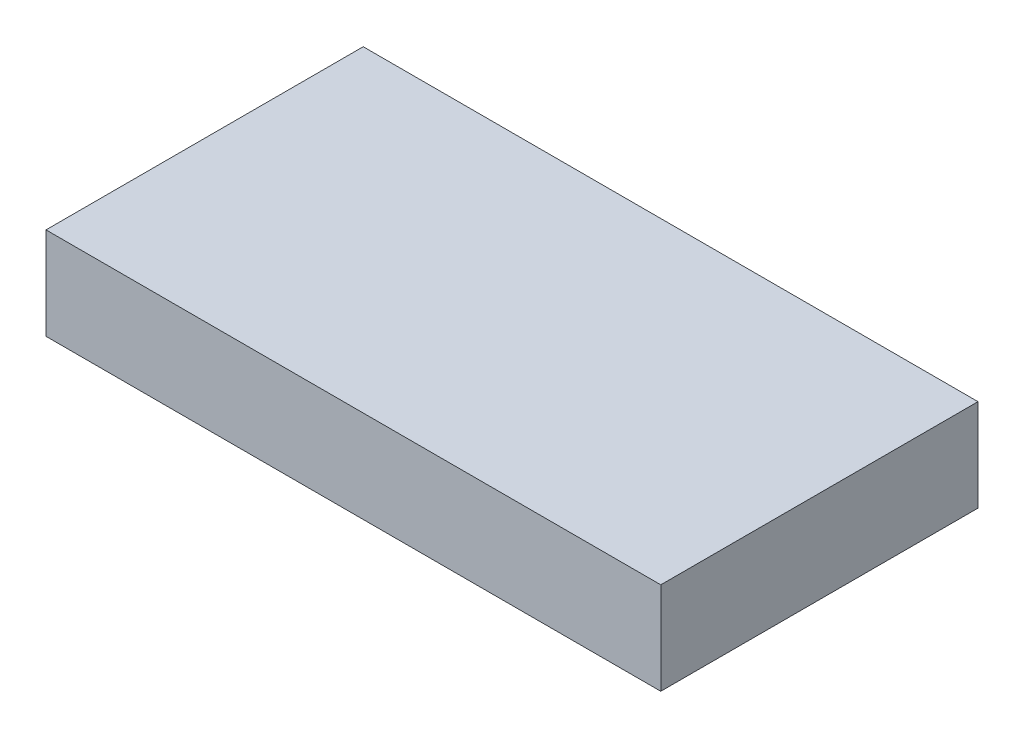
ISO-10303-21;
HEADER;
FILE_DESCRIPTION(('STEP AP214'),'2;1');
FILE_NAME('part.step','',(''),(''),'','','');
FILE_SCHEMA(('AUTOMOTIVE_DESIGN { 1 0 10303 214 1 1 1 1 }'));
ENDSEC;
DATA;
#1=APPLICATION_CONTEXT('core data for automotive mechanical design processes');
#2=APPLICATION_PROTOCOL_DEFINITION('international standard','automotive_design',2000,#1);
#3=PRODUCT_CONTEXT('',#1,'mechanical');
#4=PRODUCT('Part','Part','',(#3));
#5=PRODUCT_RELATED_PRODUCT_CATEGORY('part','',(#4));
#6=PRODUCT_DEFINITION_FORMATION('','',#4);
#7=PRODUCT_DEFINITION_CONTEXT('part definition',#1,'design');
#8=PRODUCT_DEFINITION('design','',#6,#7);
#9=PRODUCT_DEFINITION_SHAPE('','',#8);
#10=(LENGTH_UNIT() NAMED_UNIT(*) SI_UNIT(.MILLI.,.METRE.));
#11=(NAMED_UNIT(*) PLANE_ANGLE_UNIT() SI_UNIT($,.RADIAN.));
#12=(NAMED_UNIT(*) SI_UNIT($,.STERADIAN.) SOLID_ANGLE_UNIT());
#13=UNCERTAINTY_MEASURE_WITH_UNIT(LENGTH_MEASURE(1.E-05),#10,'distance_accuracy_value','');
#14=(GEOMETRIC_REPRESENTATION_CONTEXT(3) GLOBAL_UNCERTAINTY_ASSIGNED_CONTEXT((#13)) GLOBAL_UNIT_ASSIGNED_CONTEXT((#10,
#11,#12)) REPRESENTATION_CONTEXT('',''));
#15=CARTESIAN_POINT('',(0.,0.,0.));
#16=DIRECTION('',(0.,0.,1.));
#17=DIRECTION('',(1.,0.,0.));
#18=AXIS2_PLACEMENT_3D('',#15,#16,#17);
#19=CARTESIAN_POINT('',(25.,3.75,-12.9));
#20=DIRECTION('',(-1.,0.,0.));
#21=DIRECTION('',(0.,0.,1.));
#22=AXIS2_PLACEMENT_3D('',#19,#20,#21);
#23=PLANE('',#22);
#24=DIRECTION('',(0.,0.,-1.));
#25=VECTOR('',#24,1.);
#26=CARTESIAN_POINT('',(25.,-3.75,-12.9));
#27=LINE('',#26,#25);
#28=CARTESIAN_POINT('',(25.,-3.75,12.9));
#29=VERTEX_POINT('',#28);
#30=CARTESIAN_POINT('',(25.,-3.75,-12.9));
#31=VERTEX_POINT('',#30);
#32=EDGE_CURVE('E107',#29,#31,#27,.T.);
#33=ORIENTED_EDGE('',*,*,#32,.T.);
#34=DIRECTION('',(0.,-1.,0.));
#35=VECTOR('',#34,1.);
#36=CARTESIAN_POINT('',(25.,3.75,-12.9));
#37=LINE('',#36,#35);
#38=CARTESIAN_POINT('',(25.,3.75,-12.9));
#39=VERTEX_POINT('',#38);
#40=EDGE_CURVE('E11',#39,#31,#37,.T.);
#41=ORIENTED_EDGE('',*,*,#40,.F.);
#42=DIRECTION('',(0.,0.,-1.));
#43=VECTOR('',#42,1.);
#44=CARTESIAN_POINT('',(25.,3.75,-12.9));
#45=LINE('',#44,#43);
#46=CARTESIAN_POINT('',(25.,3.75,12.9));
#47=VERTEX_POINT('',#46);
#48=EDGE_CURVE('E91',#47,#39,#45,.T.);
#49=ORIENTED_EDGE('',*,*,#48,.F.);
#50=DIRECTION('',(0.,-1.,0.));
#51=VECTOR('',#50,1.);
#52=CARTESIAN_POINT('',(25.,3.75,12.9));
#53=LINE('',#52,#51);
#54=EDGE_CURVE('E103',#47,#29,#53,.T.);
#55=ORIENTED_EDGE('',*,*,#54,.T.);
#56=EDGE_LOOP('',(#33,#41,#49,#55));
#57=FACE_BOUND('',#56,.T.);
#58=ADVANCED_FACE('F39',(#57),#23,.F.);
#59=CARTESIAN_POINT('',(-25.,3.75,-12.9));
#60=DIRECTION('',(0.,0.,1.));
#61=DIRECTION('',(1.,0.,0.));
#62=AXIS2_PLACEMENT_3D('',#59,#60,#61);
#63=PLANE('',#62);
#64=DIRECTION('',(-1.,0.,0.));
#65=VECTOR('',#64,1.);
#66=CARTESIAN_POINT('',(-25.,-3.75,-12.9));
#67=LINE('',#66,#65);
#68=CARTESIAN_POINT('',(-25.,-3.75,-12.9));
#69=VERTEX_POINT('',#68);
#70=EDGE_CURVE('E96',#31,#69,#67,.T.);
#71=ORIENTED_EDGE('',*,*,#70,.T.);
#72=DIRECTION('',(0.,-1.,0.));
#73=VECTOR('',#72,1.);
#74=CARTESIAN_POINT('',(-25.,3.75,-12.9));
#75=LINE('',#74,#73);
#76=CARTESIAN_POINT('',(-25.,3.75,-12.9));
#77=VERTEX_POINT('',#76);
#78=EDGE_CURVE('E48',#77,#69,#75,.T.);
#79=ORIENTED_EDGE('',*,*,#78,.F.);
#80=DIRECTION('',(-1.,0.,0.));
#81=VECTOR('',#80,1.);
#82=CARTESIAN_POINT('',(-25.,3.75,-12.9));
#83=LINE('',#82,#81);
#84=EDGE_CURVE('E86',#39,#77,#83,.T.);
#85=ORIENTED_EDGE('',*,*,#84,.F.);
#86=ORIENTED_EDGE('',*,*,#40,.T.);
#87=EDGE_LOOP('',(#71,#79,#85,#86));
#88=FACE_BOUND('',#87,.T.);
#89=ADVANCED_FACE('F95',(#88),#63,.F.);
#90=CARTESIAN_POINT('',(-25.,3.75,-12.9));
#91=DIRECTION('',(1.,0.,0.));
#92=DIRECTION('',(0.,0.,-1.));
#93=AXIS2_PLACEMENT_3D('',#90,#91,#92);
#94=PLANE('',#93);
#95=DIRECTION('',(0.,0.,1.));
#96=VECTOR('',#95,1.);
#97=CARTESIAN_POINT('',(-25.,-3.75,-12.9));
#98=LINE('',#97,#96);
#99=CARTESIAN_POINT('',(-25.,-3.75,12.9));
#100=VERTEX_POINT('',#99);
#101=EDGE_CURVE('E73',#69,#100,#98,.T.);
#102=ORIENTED_EDGE('',*,*,#101,.T.);
#103=DIRECTION('',(0.,-1.,0.));
#104=VECTOR('',#103,1.);
#105=CARTESIAN_POINT('',(-25.,3.75,12.9));
#106=LINE('',#105,#104);
#107=CARTESIAN_POINT('',(-25.,3.75,12.9));
#108=VERTEX_POINT('',#107);
#109=EDGE_CURVE('E98',#108,#100,#106,.T.);
#110=ORIENTED_EDGE('',*,*,#109,.F.);
#111=DIRECTION('',(0.,0.,1.));
#112=VECTOR('',#111,1.);
#113=CARTESIAN_POINT('',(-25.,3.75,-12.9));
#114=LINE('',#113,#112);
#115=EDGE_CURVE('E89',#77,#108,#114,.T.);
#116=ORIENTED_EDGE('',*,*,#115,.F.);
#117=ORIENTED_EDGE('',*,*,#78,.T.);
#118=EDGE_LOOP('',(#102,#110,#116,#117));
#119=FACE_BOUND('',#118,.T.);
#120=ADVANCED_FACE('F99',(#119),#94,.F.);
#121=CARTESIAN_POINT('',(-25.,3.75,12.9));
#122=DIRECTION('',(0.,0.,-1.));
#123=DIRECTION('',(-1.,0.,0.));
#124=AXIS2_PLACEMENT_3D('',#121,#122,#123);
#125=PLANE('',#124);
#126=DIRECTION('',(1.,0.,0.));
#127=VECTOR('',#126,1.);
#128=CARTESIAN_POINT('',(-25.,-3.75,12.9));
#129=LINE('',#128,#127);
#130=EDGE_CURVE('E79',#100,#29,#129,.T.);
#131=ORIENTED_EDGE('',*,*,#130,.T.);
#132=ORIENTED_EDGE('',*,*,#54,.F.);
#133=DIRECTION('',(1.,0.,0.));
#134=VECTOR('',#133,1.);
#135=CARTESIAN_POINT('',(-25.,3.75,12.9));
#136=LINE('',#135,#134);
#137=EDGE_CURVE('E56',#108,#47,#136,.T.);
#138=ORIENTED_EDGE('',*,*,#137,.F.);
#139=ORIENTED_EDGE('',*,*,#109,.T.);
#140=EDGE_LOOP('',(#131,#132,#138,#139));
#141=FACE_BOUND('',#140,.T.);
#142=ADVANCED_FACE('F120',(#141),#125,.F.);
#143=CARTESIAN_POINT('',(0.,3.75,0.));
#144=DIRECTION('',(0.,1.,0.));
#145=DIRECTION('',(0.,0.,1.));
#146=AXIS2_PLACEMENT_3D('',#143,#144,#145);
#147=PLANE('',#146);
#148=ORIENTED_EDGE('',*,*,#48,.T.);
#149=ORIENTED_EDGE('',*,*,#84,.T.);
#150=ORIENTED_EDGE('',*,*,#115,.T.);
#151=ORIENTED_EDGE('',*,*,#137,.T.);
#152=EDGE_LOOP('',(#148,#149,#150,#151));
#153=FACE_BOUND('',#152,.T.);
#154=ADVANCED_FACE('F87',(#153),#147,.T.);
#155=CARTESIAN_POINT('',(0.,-3.75,0.));
#156=DIRECTION('',(0.,1.,0.));
#157=DIRECTION('',(0.,0.,1.));
#158=AXIS2_PLACEMENT_3D('',#155,#156,#157);
#159=PLANE('',#158);
#160=ORIENTED_EDGE('',*,*,#32,.F.);
#161=ORIENTED_EDGE('',*,*,#130,.F.);
#162=ORIENTED_EDGE('',*,*,#101,.F.);
#163=ORIENTED_EDGE('',*,*,#70,.F.);
#164=EDGE_LOOP('',(#160,#161,#162,#163));
#165=FACE_BOUND('',#164,.T.);
#166=ADVANCED_FACE('F123',(#165),#159,.F.);
#167=CLOSED_SHELL('',(#58,#89,#120,#142,#154,#166));
#168=MANIFOLD_SOLID_BREP('B2',#167);
#169=ADVANCED_BREP_SHAPE_REPRESENTATION('',(#18,#168),#14);
#170=SHAPE_DEFINITION_REPRESENTATION(#9,#169);
ENDSEC;
END-ISO-10303-21;
